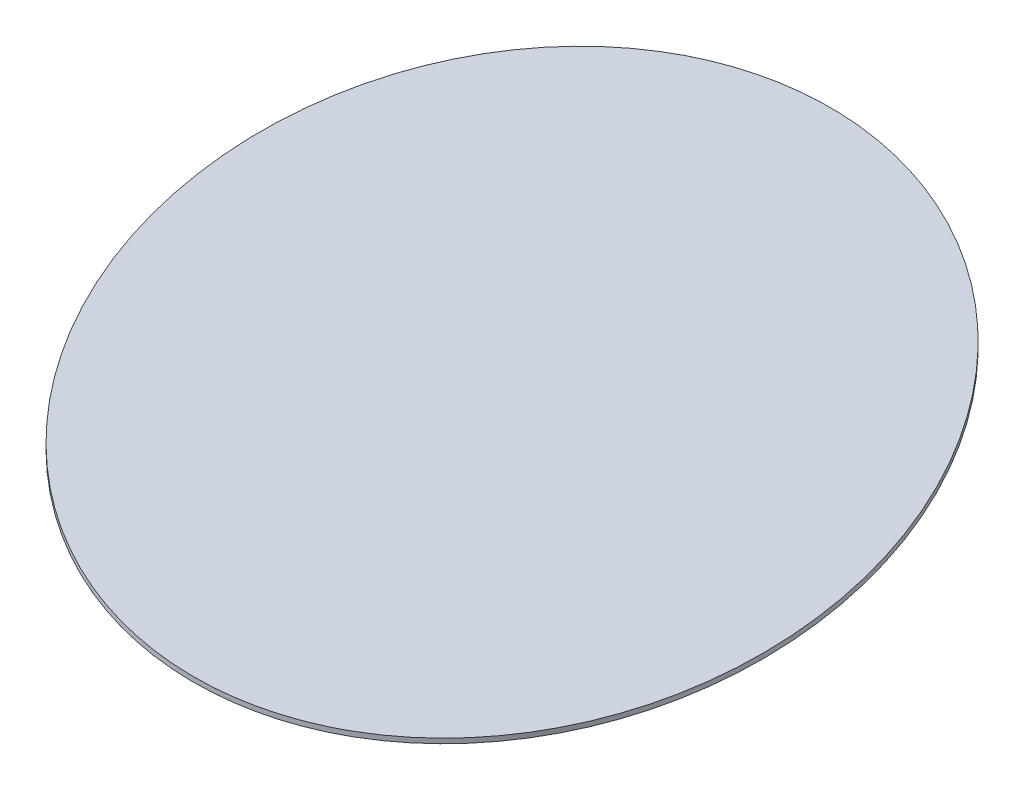
ISO-10303-21;
HEADER;
FILE_DESCRIPTION(('STEP AP214'),'2;1');
FILE_NAME('part.step','',(''),(''),'','','');
FILE_SCHEMA(('AUTOMOTIVE_DESIGN { 1 0 10303 214 1 1 1 1 }'));
ENDSEC;
DATA;
#1=APPLICATION_CONTEXT('core data for automotive mechanical design processes');
#2=APPLICATION_PROTOCOL_DEFINITION('international standard','automotive_design',2000,#1);
#3=PRODUCT_CONTEXT('',#1,'mechanical');
#4=PRODUCT('Part','Part','',(#3));
#5=PRODUCT_RELATED_PRODUCT_CATEGORY('part','',(#4));
#6=PRODUCT_DEFINITION_FORMATION('','',#4);
#7=PRODUCT_DEFINITION_CONTEXT('part definition',#1,'design');
#8=PRODUCT_DEFINITION('design','',#6,#7);
#9=PRODUCT_DEFINITION_SHAPE('','',#8);
#10=(LENGTH_UNIT() NAMED_UNIT(*) SI_UNIT(.MILLI.,.METRE.));
#11=(NAMED_UNIT(*) PLANE_ANGLE_UNIT() SI_UNIT($,.RADIAN.));
#12=(NAMED_UNIT(*) SI_UNIT($,.STERADIAN.) SOLID_ANGLE_UNIT());
#13=UNCERTAINTY_MEASURE_WITH_UNIT(LENGTH_MEASURE(1.E-05),#10,'distance_accuracy_value','');
#14=(GEOMETRIC_REPRESENTATION_CONTEXT(3) GLOBAL_UNCERTAINTY_ASSIGNED_CONTEXT((#13)) GLOBAL_UNIT_ASSIGNED_CONTEXT((#10,
#11,#12)) REPRESENTATION_CONTEXT('',''));
#15=CARTESIAN_POINT('',(0.,0.,0.));
#16=DIRECTION('',(0.,0.,1.));
#17=DIRECTION('',(1.,0.,0.));
#18=AXIS2_PLACEMENT_3D('',#15,#16,#17);
#19=CARTESIAN_POINT('',(0.,4.,0.));
#20=DIRECTION('',(0.,1.,0.));
#21=DIRECTION('',(0.500000000000001,0.,0.866025403784438));
#22=AXIS2_PLACEMENT_3D('',#19,#20,#21);
#23=ELLIPSE('',#22,355.,265.);
#24=DIRECTION('',(0.,-1.,0.));
#25=VECTOR('',#24,1.);
#26=SURFACE_OF_LINEAR_EXTRUSION('',#23,#25);
#27=CARTESIAN_POINT('',(177.5,4.,307.439018343476));
#28=VERTEX_POINT('',#27);
#29=EDGE_CURVE('E10',#28,#28,#23,.T.);
#30=ORIENTED_EDGE('',*,*,#29,.F.);
#31=EDGE_LOOP('',(#30));
#32=FACE_BOUND('',#31,.T.);
#33=CARTESIAN_POINT('',(0.,0.,0.));
#34=DIRECTION('',(0.,1.,0.));
#35=DIRECTION('',(0.500000000000001,0.,0.866025403784438));
#36=AXIS2_PLACEMENT_3D('',#33,#34,#35);
#37=ELLIPSE('',#36,355.,265.);
#38=CARTESIAN_POINT('',(177.5,0.,307.439018343476));
#39=VERTEX_POINT('',#38);
#40=EDGE_CURVE('E34',#39,#39,#37,.T.);
#41=ORIENTED_EDGE('',*,*,#40,.T.);
#42=EDGE_LOOP('',(#41));
#43=FACE_BOUND('',#42,.T.);
#44=ADVANCED_FACE('F30',(#32,#43),#26,.F.);
#45=CARTESIAN_POINT('',(0.,4.,0.));
#46=DIRECTION('',(0.,1.,0.));
#47=DIRECTION('',(0.,0.,1.));
#48=AXIS2_PLACEMENT_3D('',#45,#46,#47);
#49=PLANE('',#48);
#50=ORIENTED_EDGE('',*,*,#29,.T.);
#51=EDGE_LOOP('',(#50));
#52=FACE_BOUND('',#51,.T.);
#53=ADVANCED_FACE('F46',(#52),#49,.T.);
#54=CARTESIAN_POINT('',(0.,0.,0.));
#55=DIRECTION('',(0.,1.,0.));
#56=DIRECTION('',(0.,0.,1.));
#57=AXIS2_PLACEMENT_3D('',#54,#55,#56);
#58=PLANE('',#57);
#59=ORIENTED_EDGE('',*,*,#40,.F.);
#60=EDGE_LOOP('',(#59));
#61=FACE_BOUND('',#60,.T.);
#62=ADVANCED_FACE('F44',(#61),#58,.F.);
#63=CLOSED_SHELL('',(#44,#53,#62));
#64=MANIFOLD_SOLID_BREP('B2',#63);
#65=ADVANCED_BREP_SHAPE_REPRESENTATION('',(#18,#64),#14);
#66=SHAPE_DEFINITION_REPRESENTATION(#9,#65);
ENDSEC;
END-ISO-10303-21;
